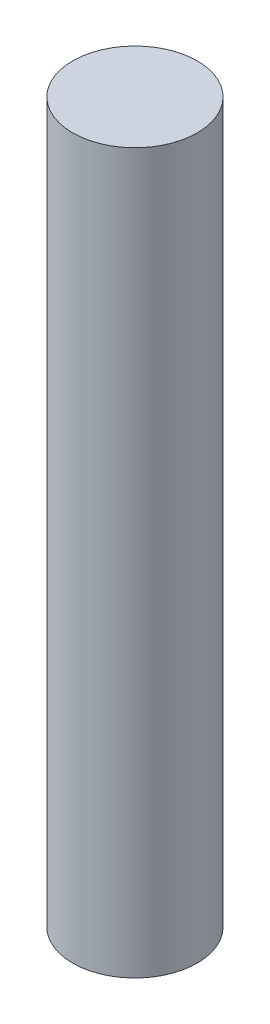
ISO-10303-21;
HEADER;
FILE_DESCRIPTION(('STEP AP214'),'2;1');
FILE_NAME('part.step','',(''),(''),'','','');
FILE_SCHEMA(('AUTOMOTIVE_DESIGN { 1 0 10303 214 1 1 1 1 }'));
ENDSEC;
DATA;
#1=APPLICATION_CONTEXT('core data for automotive mechanical design processes');
#2=APPLICATION_PROTOCOL_DEFINITION('international standard','automotive_design',2000,#1);
#3=PRODUCT_CONTEXT('',#1,'mechanical');
#4=PRODUCT('Part','Part','',(#3));
#5=PRODUCT_RELATED_PRODUCT_CATEGORY('part','',(#4));
#6=PRODUCT_DEFINITION_FORMATION('','',#4);
#7=PRODUCT_DEFINITION_CONTEXT('part definition',#1,'design');
#8=PRODUCT_DEFINITION('design','',#6,#7);
#9=PRODUCT_DEFINITION_SHAPE('','',#8);
#10=(LENGTH_UNIT() NAMED_UNIT(*) SI_UNIT(.MILLI.,.METRE.));
#11=(NAMED_UNIT(*) PLANE_ANGLE_UNIT() SI_UNIT($,.RADIAN.));
#12=(NAMED_UNIT(*) SI_UNIT($,.STERADIAN.) SOLID_ANGLE_UNIT());
#13=UNCERTAINTY_MEASURE_WITH_UNIT(LENGTH_MEASURE(1.E-05),#10,'distance_accuracy_value','');
#14=(GEOMETRIC_REPRESENTATION_CONTEXT(3) GLOBAL_UNCERTAINTY_ASSIGNED_CONTEXT((#13)) GLOBAL_UNIT_ASSIGNED_CONTEXT((#10,
#11,#12)) REPRESENTATION_CONTEXT('',''));
#15=CARTESIAN_POINT('',(0.,0.,0.));
#16=DIRECTION('',(0.,0.,1.));
#17=DIRECTION('',(1.,0.,0.));
#18=AXIS2_PLACEMENT_3D('',#15,#16,#17);
#19=CARTESIAN_POINT('',(0.,38.1,0.));
#20=DIRECTION('',(0.,-1.,0.));
#21=DIRECTION('',(0.,0.,-1.));
#22=AXIS2_PLACEMENT_3D('',#19,#20,#21);
#23=CYLINDRICAL_SURFACE('',#22,3.302);
#24=CARTESIAN_POINT('',(0.,38.1,0.));
#25=DIRECTION('',(0.,1.,0.));
#26=DIRECTION('',(0.,0.,1.));
#27=AXIS2_PLACEMENT_3D('',#24,#25,#26);
#28=CIRCLE('',#27,3.302);
#29=CARTESIAN_POINT('',(0.,38.1,3.302));
#30=VERTEX_POINT('',#29);
#31=EDGE_CURVE('E10',#30,#30,#28,.T.);
#32=ORIENTED_EDGE('',*,*,#31,.F.);
#33=EDGE_LOOP('',(#32));
#34=FACE_BOUND('',#33,.T.);
#35=CARTESIAN_POINT('',(0.,0.,0.));
#36=DIRECTION('',(0.,1.,0.));
#37=DIRECTION('',(0.,0.,1.));
#38=AXIS2_PLACEMENT_3D('',#35,#36,#37);
#39=CIRCLE('',#38,3.302);
#40=CARTESIAN_POINT('',(0.,0.,3.302));
#41=VERTEX_POINT('',#40);
#42=EDGE_CURVE('E33',#41,#41,#39,.T.);
#43=ORIENTED_EDGE('',*,*,#42,.T.);
#44=EDGE_LOOP('',(#43));
#45=FACE_BOUND('',#44,.T.);
#46=ADVANCED_FACE('F30',(#34,#45),#23,.T.);
#47=CARTESIAN_POINT('',(0.,38.1,0.));
#48=DIRECTION('',(0.,1.,0.));
#49=DIRECTION('',(0.,0.,1.));
#50=AXIS2_PLACEMENT_3D('',#47,#48,#49);
#51=PLANE('',#50);
#52=ORIENTED_EDGE('',*,*,#31,.T.);
#53=EDGE_LOOP('',(#52));
#54=FACE_BOUND('',#53,.T.);
#55=ADVANCED_FACE('F45',(#54),#51,.T.);
#56=CARTESIAN_POINT('',(0.,0.,0.));
#57=DIRECTION('',(0.,1.,0.));
#58=DIRECTION('',(0.,0.,1.));
#59=AXIS2_PLACEMENT_3D('',#56,#57,#58);
#60=PLANE('',#59);
#61=ORIENTED_EDGE('',*,*,#42,.F.);
#62=EDGE_LOOP('',(#61));
#63=FACE_BOUND('',#62,.T.);
#64=ADVANCED_FACE('F43',(#63),#60,.F.);
#65=CLOSED_SHELL('',(#46,#55,#64));
#66=MANIFOLD_SOLID_BREP('B2',#65);
#67=ADVANCED_BREP_SHAPE_REPRESENTATION('',(#18,#66),#14);
#68=SHAPE_DEFINITION_REPRESENTATION(#9,#67);
ENDSEC;
END-ISO-10303-21;
